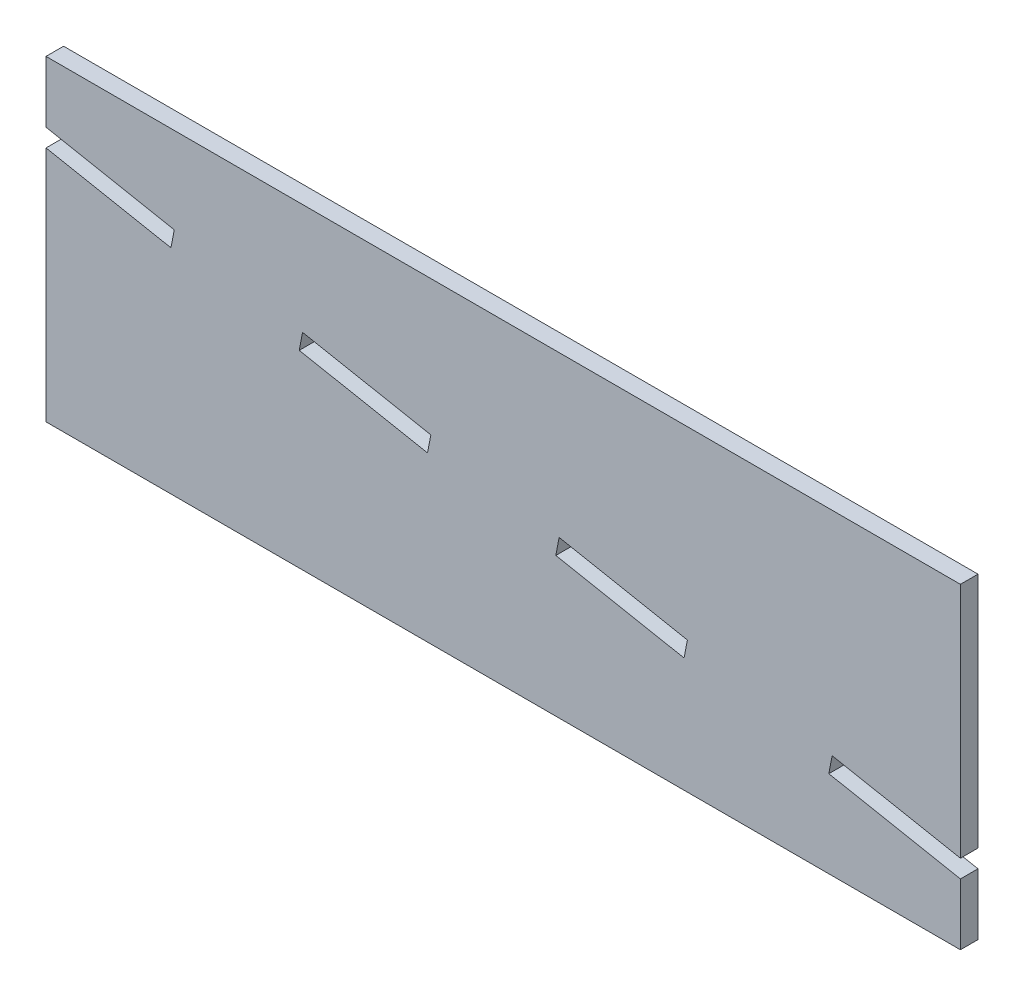
ISO-10303-21;
HEADER;
FILE_DESCRIPTION(('STEP AP214'),'2;1');
FILE_NAME('part.step','',(''),(''),'','','');
FILE_SCHEMA(('AUTOMOTIVE_DESIGN { 1 0 10303 214 1 1 1 1 }'));
ENDSEC;
DATA;
#1=APPLICATION_CONTEXT('core data for automotive mechanical design processes');
#2=APPLICATION_PROTOCOL_DEFINITION('international standard','automotive_design',2000,#1);
#3=PRODUCT_CONTEXT('',#1,'mechanical');
#4=PRODUCT('Part','Part','',(#3));
#5=PRODUCT_RELATED_PRODUCT_CATEGORY('part','',(#4));
#6=PRODUCT_DEFINITION_FORMATION('','',#4);
#7=PRODUCT_DEFINITION_CONTEXT('part definition',#1,'design');
#8=PRODUCT_DEFINITION('design','',#6,#7);
#9=PRODUCT_DEFINITION_SHAPE('','',#8);
#10=(LENGTH_UNIT() NAMED_UNIT(*) SI_UNIT(.MILLI.,.METRE.));
#11=(NAMED_UNIT(*) PLANE_ANGLE_UNIT() SI_UNIT($,.RADIAN.));
#12=(NAMED_UNIT(*) SI_UNIT($,.STERADIAN.) SOLID_ANGLE_UNIT());
#13=UNCERTAINTY_MEASURE_WITH_UNIT(LENGTH_MEASURE(1.E-05),#10,'distance_accuracy_value','');
#14=(GEOMETRIC_REPRESENTATION_CONTEXT(3) GLOBAL_UNCERTAINTY_ASSIGNED_CONTEXT((#13)) GLOBAL_UNIT_ASSIGNED_CONTEXT((#10,
#11,#12)) REPRESENTATION_CONTEXT('',''));
#15=CARTESIAN_POINT('',(0.,0.,0.));
#16=DIRECTION('',(0.,0.,1.));
#17=DIRECTION('',(1.,0.,0.));
#18=AXIS2_PLACEMENT_3D('',#15,#16,#17);
#19=CARTESIAN_POINT('',(0.,0.,5.));
#20=DIRECTION('',(0.,0.,-1.));
#21=DIRECTION('',(-1.,0.,0.));
#22=AXIS2_PLACEMENT_3D('',#19,#20,#21);
#23=PLANE('',#22);
#24=DIRECTION('',(0.982006446980647,-0.188847393650125,0.));
#25=VECTOR('',#24,1.);
#26=CARTESIAN_POINT('',(108.47933855245,46.5927806062838,5.));
#27=LINE('',#26,#25);
#28=CARTESIAN_POINT('',(72.0048133788832,53.6071123704313,5.));
#29=VERTEX_POINT('',#28);
#30=CARTESIAN_POINT('',(108.47933855245,46.5927806062838,5.));
#31=VERTEX_POINT('',#30);
#32=EDGE_CURVE('E226',#29,#31,#27,.T.);
#33=ORIENTED_EDGE('',*,*,#32,.F.);
#34=DIRECTION('',(-0.188847393650126,-0.982006446980647,0.));
#35=VECTOR('',#34,1.);
#36=CARTESIAN_POINT('',(72.0048133788832,53.6071123704313,5.));
#37=LINE('',#36,#35);
#38=CARTESIAN_POINT('',(72.9490503471338,58.5171446053346,5.));
#39=VERTEX_POINT('',#38);
#40=EDGE_CURVE('E223',#39,#29,#37,.T.);
#41=ORIENTED_EDGE('',*,*,#40,.F.);
#42=DIRECTION('',(-0.982006446980647,0.188847393650124,0.));
#43=VECTOR('',#42,1.);
#44=CARTESIAN_POINT('',(72.9490503471338,58.5171446053346,5.));
#45=LINE('',#44,#43);
#46=CARTESIAN_POINT('',(109.423575520701,51.5028128411871,5.));
#47=VERTEX_POINT('',#46);
#48=EDGE_CURVE('E233',#47,#39,#45,.T.);
#49=ORIENTED_EDGE('',*,*,#48,.F.);
#50=DIRECTION('',(0.188847393650129,0.982006446980647,0.));
#51=VECTOR('',#50,1.);
#52=CARTESIAN_POINT('',(108.951457036575,49.0477967237355,5.));
#53=LINE('',#52,#51);
#54=EDGE_CURVE('E230',#31,#47,#53,.T.);
#55=ORIENTED_EDGE('',*,*,#54,.F.);
#56=EDGE_LOOP('',(#33,#41,#49,#55));
#57=FACE_BOUND('',#56,.T.);
#58=DIRECTION('',(0.,-1.,0.));
#59=VECTOR('',#58,1.);
#60=CARTESIAN_POINT('',(0.,0.,5.));
#61=LINE('',#60,#59);
#62=CARTESIAN_POINT('',(0.,67.4541918663705,5.));
#63=VERTEX_POINT('',#62);
#64=CARTESIAN_POINT('',(0.,0.,5.));
#65=VERTEX_POINT('',#64);
#66=EDGE_CURVE('E265',#63,#65,#61,.T.);
#67=ORIENTED_EDGE('',*,*,#66,.T.);
#68=DIRECTION('',(1.,0.,0.));
#69=VECTOR('',#68,1.);
#70=CARTESIAN_POINT('',(0.,0.,5.));
#71=LINE('',#70,#69);
#72=CARTESIAN_POINT('',(260.,0.,5.));
#73=VERTEX_POINT('',#72);
#74=EDGE_CURVE('E269',#65,#73,#71,.T.);
#75=ORIENTED_EDGE('',*,*,#74,.T.);
#76=DIRECTION('',(0.,1.,0.));
#77=VECTOR('',#76,1.);
#78=CARTESIAN_POINT('',(260.,0.,5.));
#79=LINE('',#78,#77);
#80=CARTESIAN_POINT('',(260.,17.4541918663704,5.));
#81=VERTEX_POINT('',#80);
#82=EDGE_CURVE('E273',#73,#81,#79,.T.);
#83=ORIENTED_EDGE('',*,*,#82,.T.);
#84=DIRECTION('',(-0.982006446980647,0.188847393650125,0.));
#85=VECTOR('',#84,1.);
#86=CARTESIAN_POINT('',(260.,17.4541918663704,5.));
#87=LINE('',#86,#85);
#88=CARTESIAN_POINT('',(222.581237858183,24.6501076628737,5.));
#89=VERTEX_POINT('',#88);
#90=EDGE_CURVE('E276',#81,#89,#87,.T.);
#91=ORIENTED_EDGE('',*,*,#90,.T.);
#92=DIRECTION('',(0.188847393650121,0.982006446980648,0.));
#93=VECTOR('',#92,1.);
#94=CARTESIAN_POINT('',(222.581237858183,24.6501076628737,5.));
#95=LINE('',#94,#93);
#96=CARTESIAN_POINT('',(223.525474826433,29.560139897777,5.));
#97=VERTEX_POINT('',#96);
#98=EDGE_CURVE('E279',#89,#97,#95,.T.);
#99=ORIENTED_EDGE('',*,*,#98,.T.);
#100=DIRECTION('',(0.982006446980647,-0.188847393650125,0.));
#101=VECTOR('',#100,1.);
#102=CARTESIAN_POINT('',(223.525474826433,29.560139897777,5.));
#103=LINE('',#102,#101);
#104=CARTESIAN_POINT('',(260.,22.5458081336295,5.));
#105=VERTEX_POINT('',#104);
#106=EDGE_CURVE('E282',#97,#105,#103,.T.);
#107=ORIENTED_EDGE('',*,*,#106,.T.);
#108=DIRECTION('',(0.,1.,0.));
#109=VECTOR('',#108,1.);
#110=CARTESIAN_POINT('',(260.,22.5458081336295,5.));
#111=LINE('',#110,#109);
#112=CARTESIAN_POINT('',(260.,90.,5.));
#113=VERTEX_POINT('',#112);
#114=EDGE_CURVE('E285',#105,#113,#111,.T.);
#115=ORIENTED_EDGE('',*,*,#114,.T.);
#116=DIRECTION('',(-1.,0.,0.));
#117=VECTOR('',#116,1.);
#118=CARTESIAN_POINT('',(0.,90.,5.));
#119=LINE('',#118,#117);
#120=CARTESIAN_POINT('',(0.,90.,5.));
#121=VERTEX_POINT('',#120);
#122=EDGE_CURVE('E288',#113,#121,#119,.T.);
#123=ORIENTED_EDGE('',*,*,#122,.T.);
#124=DIRECTION('',(0.,-1.,0.));
#125=VECTOR('',#124,1.);
#126=CARTESIAN_POINT('',(0.,72.5458081336296,5.));
#127=LINE('',#126,#125);
#128=CARTESIAN_POINT('',(0.,72.5458081336296,5.));
#129=VERTEX_POINT('',#128);
#130=EDGE_CURVE('E291',#121,#129,#127,.T.);
#131=ORIENTED_EDGE('',*,*,#130,.T.);
#132=DIRECTION('',(0.982006446980647,-0.188847393650125,0.));
#133=VECTOR('',#132,1.);
#134=CARTESIAN_POINT('',(36.4745251735669,65.5314763694821,5.));
#135=LINE('',#134,#133);
#136=CARTESIAN_POINT('',(36.4745251735669,65.5314763694821,5.));
#137=VERTEX_POINT('',#136);
#138=EDGE_CURVE('E294',#129,#137,#135,.T.);
#139=ORIENTED_EDGE('',*,*,#138,.T.);
#140=DIRECTION('',(-0.188847393650124,-0.982006446980647,0.));
#141=VECTOR('',#140,1.);
#142=CARTESIAN_POINT('',(36.0024066894416,63.0764602520305,5.));
#143=LINE('',#142,#141);
#144=CARTESIAN_POINT('',(35.5302882053163,60.6214441345788,5.));
#145=VERTEX_POINT('',#144);
#146=EDGE_CURVE('E297',#137,#145,#143,.T.);
#147=ORIENTED_EDGE('',*,*,#146,.T.);
#148=DIRECTION('',(-0.982006446980647,0.188847393650125,0.));
#149=VECTOR('',#148,1.);
#150=CARTESIAN_POINT('',(0.,67.4541918663705,5.));
#151=LINE('',#150,#149);
#152=EDGE_CURVE('E300',#145,#63,#151,.T.);
#153=ORIENTED_EDGE('',*,*,#152,.T.);
#154=EDGE_LOOP('',(#67,#75,#83,#91,#99,#107,#115,#123,#131,#139,#147,#153));
#155=FACE_BOUND('',#154,.T.);
#156=DIRECTION('',(0.982006446980647,-0.188847393650125,0.));
#157=VECTOR('',#156,1.);
#158=CARTESIAN_POINT('',(181.428388899584,32.5641170779889,5.));
#159=LINE('',#158,#157);
#160=CARTESIAN_POINT('',(144.953863726017,39.5784488421363,5.));
#161=VERTEX_POINT('',#160);
#162=CARTESIAN_POINT('',(181.428388899584,32.5641170779889,5.));
#163=VERTEX_POINT('',#162);
#164=EDGE_CURVE('E180',#161,#163,#159,.T.);
#165=ORIENTED_EDGE('',*,*,#164,.F.);
#166=DIRECTION('',(-0.188847393650111,-0.98200644698065,0.));
#167=VECTOR('',#166,1.);
#168=CARTESIAN_POINT('',(144.953863726017,39.5784488421363,5.));
#169=LINE('',#168,#167);
#170=CARTESIAN_POINT('',(145.898100694268,44.4884810770396,5.));
#171=VERTEX_POINT('',#170);
#172=EDGE_CURVE('E174',#171,#161,#169,.T.);
#173=ORIENTED_EDGE('',*,*,#172,.F.);
#174=DIRECTION('',(-0.982006446980647,0.188847393650125,0.));
#175=VECTOR('',#174,1.);
#176=CARTESIAN_POINT('',(145.898100694268,44.4884810770396,5.));
#177=LINE('',#176,#175);
#178=CARTESIAN_POINT('',(182.372625867834,37.4741493128921,5.));
#179=VERTEX_POINT('',#178);
#180=EDGE_CURVE('E199',#179,#171,#177,.T.);
#181=ORIENTED_EDGE('',*,*,#180,.F.);
#182=DIRECTION('',(0.188847393650122,0.982006446980648,0.));
#183=VECTOR('',#182,1.);
#184=CARTESIAN_POINT('',(181.900507383709,35.0191331954405,5.));
#185=LINE('',#184,#183);
#186=EDGE_CURVE('E195',#163,#179,#185,.T.);
#187=ORIENTED_EDGE('',*,*,#186,.F.);
#188=EDGE_LOOP('',(#165,#173,#181,#187));
#189=FACE_BOUND('',#188,.T.);
#190=ADVANCED_FACE('F39',(#57,#155,#189),#23,.F.);
#191=CARTESIAN_POINT('',(0.,0.,0.));
#192=DIRECTION('',(0.,0.,-1.));
#193=DIRECTION('',(-1.,0.,0.));
#194=AXIS2_PLACEMENT_3D('',#191,#192,#193);
#195=PLANE('',#194);
#196=DIRECTION('',(0.,-1.,0.));
#197=VECTOR('',#196,1.);
#198=CARTESIAN_POINT('',(0.,0.,0.));
#199=LINE('',#198,#197);
#200=CARTESIAN_POINT('',(0.,67.4541918663705,0.));
#201=VERTEX_POINT('',#200);
#202=CARTESIAN_POINT('',(0.,0.,0.));
#203=VERTEX_POINT('',#202);
#204=EDGE_CURVE('E264',#201,#203,#199,.T.);
#205=ORIENTED_EDGE('',*,*,#204,.F.);
#206=DIRECTION('',(-0.982006446980647,0.188847393650125,0.));
#207=VECTOR('',#206,1.);
#208=CARTESIAN_POINT('',(0.,67.4541918663705,0.));
#209=LINE('',#208,#207);
#210=CARTESIAN_POINT('',(35.5302882053163,60.6214441345788,0.));
#211=VERTEX_POINT('',#210);
#212=EDGE_CURVE('E270',#211,#201,#209,.T.);
#213=ORIENTED_EDGE('',*,*,#212,.F.);
#214=DIRECTION('',(-0.188847393650124,-0.982006446980648,0.));
#215=VECTOR('',#214,1.);
#216=CARTESIAN_POINT('',(35.5302882053163,60.6214441345788,0.));
#217=LINE('',#216,#215);
#218=CARTESIAN_POINT('',(36.4745251735669,65.5314763694821,0.));
#219=VERTEX_POINT('',#218);
#220=EDGE_CURVE('E336',#219,#211,#217,.T.);
#221=ORIENTED_EDGE('',*,*,#220,.F.);
#222=DIRECTION('',(0.982006446980647,-0.188847393650125,0.));
#223=VECTOR('',#222,1.);
#224=CARTESIAN_POINT('',(36.4745251735669,65.5314763694821,0.));
#225=LINE('',#224,#223);
#226=CARTESIAN_POINT('',(0.,72.5458081336296,0.));
#227=VERTEX_POINT('',#226);
#228=EDGE_CURVE('E332',#227,#219,#225,.T.);
#229=ORIENTED_EDGE('',*,*,#228,.F.);
#230=DIRECTION('',(0.,-1.,0.));
#231=VECTOR('',#230,1.);
#232=CARTESIAN_POINT('',(0.,72.5458081336296,0.));
#233=LINE('',#232,#231);
#234=CARTESIAN_POINT('',(0.,90.,0.));
#235=VERTEX_POINT('',#234);
#236=EDGE_CURVE('E329',#235,#227,#233,.T.);
#237=ORIENTED_EDGE('',*,*,#236,.F.);
#238=DIRECTION('',(-1.,0.,0.));
#239=VECTOR('',#238,1.);
#240=CARTESIAN_POINT('',(0.,90.,0.));
#241=LINE('',#240,#239);
#242=CARTESIAN_POINT('',(260.,90.,0.));
#243=VERTEX_POINT('',#242);
#244=EDGE_CURVE('E326',#243,#235,#241,.T.);
#245=ORIENTED_EDGE('',*,*,#244,.F.);
#246=DIRECTION('',(0.,1.,0.));
#247=VECTOR('',#246,1.);
#248=CARTESIAN_POINT('',(260.,22.5458081336295,0.));
#249=LINE('',#248,#247);
#250=CARTESIAN_POINT('',(260.,22.5458081336295,0.));
#251=VERTEX_POINT('',#250);
#252=EDGE_CURVE('E323',#251,#243,#249,.T.);
#253=ORIENTED_EDGE('',*,*,#252,.F.);
#254=DIRECTION('',(0.982006446980647,-0.188847393650125,0.));
#255=VECTOR('',#254,1.);
#256=CARTESIAN_POINT('',(223.525474826433,29.560139897777,0.));
#257=LINE('',#256,#255);
#258=CARTESIAN_POINT('',(223.525474826433,29.560139897777,0.));
#259=VERTEX_POINT('',#258);
#260=EDGE_CURVE('E320',#259,#251,#257,.T.);
#261=ORIENTED_EDGE('',*,*,#260,.F.);
#262=DIRECTION('',(0.188847393650098,0.982006446980652,0.));
#263=VECTOR('',#262,1.);
#264=CARTESIAN_POINT('',(223.053356342308,27.1051237803254,0.));
#265=LINE('',#264,#263);
#266=CARTESIAN_POINT('',(222.581237858183,24.6501076628737,0.));
#267=VERTEX_POINT('',#266);
#268=EDGE_CURVE('E317',#267,#259,#265,.T.);
#269=ORIENTED_EDGE('',*,*,#268,.F.);
#270=DIRECTION('',(-0.982006446980647,0.188847393650125,0.));
#271=VECTOR('',#270,1.);
#272=CARTESIAN_POINT('',(260.,17.4541918663704,0.));
#273=LINE('',#272,#271);
#274=CARTESIAN_POINT('',(260.,17.4541918663704,0.));
#275=VERTEX_POINT('',#274);
#276=EDGE_CURVE('E313',#275,#267,#273,.T.);
#277=ORIENTED_EDGE('',*,*,#276,.F.);
#278=DIRECTION('',(0.,1.,0.));
#279=VECTOR('',#278,1.);
#280=CARTESIAN_POINT('',(260.,0.,0.));
#281=LINE('',#280,#279);
#282=CARTESIAN_POINT('',(260.,0.,0.));
#283=VERTEX_POINT('',#282);
#284=EDGE_CURVE('E310',#283,#275,#281,.T.);
#285=ORIENTED_EDGE('',*,*,#284,.F.);
#286=DIRECTION('',(1.,0.,0.));
#287=VECTOR('',#286,1.);
#288=CARTESIAN_POINT('',(0.,0.,0.));
#289=LINE('',#288,#287);
#290=EDGE_CURVE('E307',#203,#283,#289,.T.);
#291=ORIENTED_EDGE('',*,*,#290,.F.);
#292=EDGE_LOOP('',(#205,#213,#221,#229,#237,#245,#253,#261,#269,#277,#285,#291));
#293=FACE_BOUND('',#292,.T.);
#294=DIRECTION('',(-0.188847393650122,-0.982006446980648,0.));
#295=VECTOR('',#294,1.);
#296=CARTESIAN_POINT('',(72.4769318630085,56.062128487883,0.));
#297=LINE('',#296,#295);
#298=CARTESIAN_POINT('',(72.9490503471338,58.5171446053346,0.));
#299=VERTEX_POINT('',#298);
#300=CARTESIAN_POINT('',(72.0048133788832,53.6071123704313,0.));
#301=VERTEX_POINT('',#300);
#302=EDGE_CURVE('E227',#299,#301,#297,.T.);
#303=ORIENTED_EDGE('',*,*,#302,.T.);
#304=DIRECTION('',(0.982006446980647,-0.188847393650125,0.));
#305=VECTOR('',#304,1.);
#306=CARTESIAN_POINT('',(108.47933855245,46.5927806062838,0.));
#307=LINE('',#306,#305);
#308=CARTESIAN_POINT('',(108.47933855245,46.5927806062838,0.));
#309=VERTEX_POINT('',#308);
#310=EDGE_CURVE('E191',#301,#309,#307,.T.);
#311=ORIENTED_EDGE('',*,*,#310,.T.);
#312=DIRECTION('',(0.188847393650112,0.98200644698065,0.));
#313=VECTOR('',#312,1.);
#314=CARTESIAN_POINT('',(109.423575520701,51.5028128411871,0.));
#315=LINE('',#314,#313);
#316=CARTESIAN_POINT('',(109.423575520701,51.5028128411871,0.));
#317=VERTEX_POINT('',#316);
#318=EDGE_CURVE('E241',#309,#317,#315,.T.);
#319=ORIENTED_EDGE('',*,*,#318,.T.);
#320=DIRECTION('',(-0.982006446980647,0.188847393650124,0.));
#321=VECTOR('',#320,1.);
#322=CARTESIAN_POINT('',(72.9490503471338,58.5171446053346,0.));
#323=LINE('',#322,#321);
#324=EDGE_CURVE('E245',#317,#299,#323,.T.);
#325=ORIENTED_EDGE('',*,*,#324,.T.);
#326=EDGE_LOOP('',(#303,#311,#319,#325));
#327=FACE_BOUND('',#326,.T.);
#328=DIRECTION('',(-0.188847393650119,-0.982006446980648,0.));
#329=VECTOR('',#328,1.);
#330=CARTESIAN_POINT('',(145.425982210142,42.033464959588,0.));
#331=LINE('',#330,#329);
#332=CARTESIAN_POINT('',(145.898100694268,44.4884810770396,0.));
#333=VERTEX_POINT('',#332);
#334=CARTESIAN_POINT('',(144.953863726017,39.5784488421364,0.));
#335=VERTEX_POINT('',#334);
#336=EDGE_CURVE('E181',#333,#335,#331,.T.);
#337=ORIENTED_EDGE('',*,*,#336,.T.);
#338=DIRECTION('',(0.982006446980647,-0.188847393650125,0.));
#339=VECTOR('',#338,1.);
#340=CARTESIAN_POINT('',(181.428388899584,32.5641170779889,0.));
#341=LINE('',#340,#339);
#342=CARTESIAN_POINT('',(181.428388899584,32.5641170779889,0.));
#343=VERTEX_POINT('',#342);
#344=EDGE_CURVE('E188',#335,#343,#341,.T.);
#345=ORIENTED_EDGE('',*,*,#344,.T.);
#346=DIRECTION('',(0.188847393650119,0.982006446980648,0.));
#347=VECTOR('',#346,1.);
#348=CARTESIAN_POINT('',(182.372625867834,37.4741493128921,0.));
#349=LINE('',#348,#347);
#350=CARTESIAN_POINT('',(182.372625867834,37.4741493128921,0.));
#351=VERTEX_POINT('',#350);
#352=EDGE_CURVE('E206',#343,#351,#349,.T.);
#353=ORIENTED_EDGE('',*,*,#352,.T.);
#354=DIRECTION('',(-0.982006446980647,0.188847393650125,0.));
#355=VECTOR('',#354,1.);
#356=CARTESIAN_POINT('',(145.898100694268,44.4884810770396,0.));
#357=LINE('',#356,#355);
#358=EDGE_CURVE('E210',#351,#333,#357,.T.);
#359=ORIENTED_EDGE('',*,*,#358,.T.);
#360=EDGE_LOOP('',(#337,#345,#353,#359));
#361=FACE_BOUND('',#360,.T.);
#362=ADVANCED_FACE('F391',(#293,#327,#361),#195,.T.);
#363=CARTESIAN_POINT('',(0.,0.,5.));
#364=DIRECTION('',(1.,0.,0.));
#365=DIRECTION('',(0.,0.,-1.));
#366=AXIS2_PLACEMENT_3D('',#363,#364,#365);
#367=PLANE('',#366);
#368=ORIENTED_EDGE('',*,*,#204,.T.);
#369=DIRECTION('',(0.,0.,-1.));
#370=VECTOR('',#369,1.);
#371=CARTESIAN_POINT('',(0.,0.,5.));
#372=LINE('',#371,#370);
#373=EDGE_CURVE('E11',#65,#203,#372,.T.);
#374=ORIENTED_EDGE('',*,*,#373,.F.);
#375=ORIENTED_EDGE('',*,*,#66,.F.);
#376=DIRECTION('',(0.,0.,-1.));
#377=VECTOR('',#376,1.);
#378=CARTESIAN_POINT('',(0.,67.4541918663705,5.));
#379=LINE('',#378,#377);
#380=EDGE_CURVE('E303',#63,#201,#379,.T.);
#381=ORIENTED_EDGE('',*,*,#380,.T.);
#382=EDGE_LOOP('',(#368,#374,#375,#381));
#383=FACE_BOUND('',#382,.T.);
#384=ADVANCED_FACE('F41',(#383),#367,.F.);
#385=CARTESIAN_POINT('',(0.,0.,5.));
#386=DIRECTION('',(0.,1.,0.));
#387=DIRECTION('',(-1.,0.,0.));
#388=AXIS2_PLACEMENT_3D('',#385,#386,#387);
#389=PLANE('',#388);
#390=ORIENTED_EDGE('',*,*,#290,.T.);
#391=DIRECTION('',(0.,0.,-1.));
#392=VECTOR('',#391,1.);
#393=CARTESIAN_POINT('',(260.,0.,5.));
#394=LINE('',#393,#392);
#395=EDGE_CURVE('E48',#73,#283,#394,.T.);
#396=ORIENTED_EDGE('',*,*,#395,.F.);
#397=ORIENTED_EDGE('',*,*,#74,.F.);
#398=ORIENTED_EDGE('',*,*,#373,.T.);
#399=EDGE_LOOP('',(#390,#396,#397,#398));
#400=FACE_BOUND('',#399,.T.);
#401=ADVANCED_FACE('F407',(#400),#389,.F.);
#402=CARTESIAN_POINT('',(260.,0.,5.));
#403=DIRECTION('',(-1.,0.,0.));
#404=DIRECTION('',(0.,0.,1.));
#405=AXIS2_PLACEMENT_3D('',#402,#403,#404);
#406=PLANE('',#405);
#407=ORIENTED_EDGE('',*,*,#284,.T.);
#408=DIRECTION('',(0.,0.,-1.));
#409=VECTOR('',#408,1.);
#410=CARTESIAN_POINT('',(260.,17.4541918663704,5.));
#411=LINE('',#410,#409);
#412=EDGE_CURVE('E376',#81,#275,#411,.T.);
#413=ORIENTED_EDGE('',*,*,#412,.F.);
#414=ORIENTED_EDGE('',*,*,#82,.F.);
#415=ORIENTED_EDGE('',*,*,#395,.T.);
#416=EDGE_LOOP('',(#407,#413,#414,#415));
#417=FACE_BOUND('',#416,.T.);
#418=ADVANCED_FACE('F385',(#417),#406,.F.);
#419=CARTESIAN_POINT('',(260.,17.4541918663704,5.));
#420=DIRECTION('',(-0.188847393650125,-0.982006446980647,0.));
#421=DIRECTION('',(0.982006446980647,-0.188847393650125,0.));
#422=AXIS2_PLACEMENT_3D('',#419,#420,#421);
#423=PLANE('',#422);
#424=ORIENTED_EDGE('',*,*,#276,.T.);
#425=DIRECTION('',(0.,0.,-1.));
#426=VECTOR('',#425,1.);
#427=CARTESIAN_POINT('',(222.581237858183,24.6501076628737,5.));
#428=LINE('',#427,#426);
#429=EDGE_CURVE('E372',#89,#267,#428,.T.);
#430=ORIENTED_EDGE('',*,*,#429,.F.);
#431=ORIENTED_EDGE('',*,*,#90,.F.);
#432=ORIENTED_EDGE('',*,*,#412,.T.);
#433=EDGE_LOOP('',(#424,#430,#431,#432));
#434=FACE_BOUND('',#433,.T.);
#435=ADVANCED_FACE('F396',(#434),#423,.F.);
#436=CARTESIAN_POINT('',(223.053356342308,27.1051237803254,5.));
#437=DIRECTION('',(-0.982006446980653,0.188847393650098,0.));
#438=DIRECTION('',(-0.188847393650098,-0.982006446980653,0.));
#439=AXIS2_PLACEMENT_3D('',#436,#437,#438);
#440=PLANE('',#439);
#441=ORIENTED_EDGE('',*,*,#268,.T.);
#442=DIRECTION('',(0.,0.,-1.));
#443=VECTOR('',#442,1.);
#444=CARTESIAN_POINT('',(223.525474826433,29.560139897777,5.));
#445=LINE('',#444,#443);
#446=EDGE_CURVE('E368',#97,#259,#445,.T.);
#447=ORIENTED_EDGE('',*,*,#446,.F.);
#448=ORIENTED_EDGE('',*,*,#98,.F.);
#449=ORIENTED_EDGE('',*,*,#429,.T.);
#450=EDGE_LOOP('',(#441,#447,#448,#449));
#451=FACE_BOUND('',#450,.T.);
#452=ADVANCED_FACE('F400',(#451),#440,.F.);
#453=CARTESIAN_POINT('',(223.525474826433,29.560139897777,5.));
#454=DIRECTION('',(0.188847393650125,0.982006446980647,0.));
#455=DIRECTION('',(-0.982006446980647,0.188847393650125,0.));
#456=AXIS2_PLACEMENT_3D('',#453,#454,#455);
#457=PLANE('',#456);
#458=ORIENTED_EDGE('',*,*,#260,.T.);
#459=DIRECTION('',(0.,0.,-1.));
#460=VECTOR('',#459,1.);
#461=CARTESIAN_POINT('',(260.,22.5458081336295,5.));
#462=LINE('',#461,#460);
#463=EDGE_CURVE('E364',#105,#251,#462,.T.);
#464=ORIENTED_EDGE('',*,*,#463,.F.);
#465=ORIENTED_EDGE('',*,*,#106,.F.);
#466=ORIENTED_EDGE('',*,*,#446,.T.);
#467=EDGE_LOOP('',(#458,#464,#465,#466));
#468=FACE_BOUND('',#467,.T.);
#469=ADVANCED_FACE('F439',(#468),#457,.F.);
#470=CARTESIAN_POINT('',(260.,22.5458081336295,5.));
#471=DIRECTION('',(-1.,0.,0.));
#472=DIRECTION('',(0.,0.,1.));
#473=AXIS2_PLACEMENT_3D('',#470,#471,#472);
#474=PLANE('',#473);
#475=ORIENTED_EDGE('',*,*,#252,.T.);
#476=DIRECTION('',(0.,0.,-1.));
#477=VECTOR('',#476,1.);
#478=CARTESIAN_POINT('',(260.,90.,5.));
#479=LINE('',#478,#477);
#480=EDGE_CURVE('E360',#113,#243,#479,.T.);
#481=ORIENTED_EDGE('',*,*,#480,.F.);
#482=ORIENTED_EDGE('',*,*,#114,.F.);
#483=ORIENTED_EDGE('',*,*,#463,.T.);
#484=EDGE_LOOP('',(#475,#481,#482,#483));
#485=FACE_BOUND('',#484,.T.);
#486=ADVANCED_FACE('F437',(#485),#474,.F.);
#487=CARTESIAN_POINT('',(0.,90.,5.));
#488=DIRECTION('',(0.,-1.,0.));
#489=DIRECTION('',(0.,0.,-1.));
#490=AXIS2_PLACEMENT_3D('',#487,#488,#489);
#491=PLANE('',#490);
#492=ORIENTED_EDGE('',*,*,#244,.T.);
#493=DIRECTION('',(0.,0.,-1.));
#494=VECTOR('',#493,1.);
#495=CARTESIAN_POINT('',(0.,90.,5.));
#496=LINE('',#495,#494);
#497=EDGE_CURVE('E356',#121,#235,#496,.T.);
#498=ORIENTED_EDGE('',*,*,#497,.F.);
#499=ORIENTED_EDGE('',*,*,#122,.F.);
#500=ORIENTED_EDGE('',*,*,#480,.T.);
#501=EDGE_LOOP('',(#492,#498,#499,#500));
#502=FACE_BOUND('',#501,.T.);
#503=ADVANCED_FACE('F433',(#502),#491,.F.);
#504=CARTESIAN_POINT('',(0.,72.5458081336296,5.));
#505=DIRECTION('',(1.,0.,0.));
#506=DIRECTION('',(0.,1.,0.));
#507=AXIS2_PLACEMENT_3D('',#504,#505,#506);
#508=PLANE('',#507);
#509=ORIENTED_EDGE('',*,*,#236,.T.);
#510=DIRECTION('',(0.,0.,-1.));
#511=VECTOR('',#510,1.);
#512=CARTESIAN_POINT('',(0.,72.5458081336296,5.));
#513=LINE('',#512,#511);
#514=EDGE_CURVE('E352',#129,#227,#513,.T.);
#515=ORIENTED_EDGE('',*,*,#514,.F.);
#516=ORIENTED_EDGE('',*,*,#130,.F.);
#517=ORIENTED_EDGE('',*,*,#497,.T.);
#518=EDGE_LOOP('',(#509,#515,#516,#517));
#519=FACE_BOUND('',#518,.T.);
#520=ADVANCED_FACE('F428',(#519),#508,.F.);
#521=CARTESIAN_POINT('',(36.4745251735669,65.5314763694821,5.));
#522=DIRECTION('',(0.188847393650125,0.982006446980647,0.));
#523=DIRECTION('',(-0.982006446980647,0.188847393650125,0.));
#524=AXIS2_PLACEMENT_3D('',#521,#522,#523);
#525=PLANE('',#524);
#526=ORIENTED_EDGE('',*,*,#228,.T.);
#527=DIRECTION('',(0.,0.,-1.));
#528=VECTOR('',#527,1.);
#529=CARTESIAN_POINT('',(36.4745251735669,65.5314763694821,5.));
#530=LINE('',#529,#528);
#531=EDGE_CURVE('E348',#137,#219,#530,.T.);
#532=ORIENTED_EDGE('',*,*,#531,.F.);
#533=ORIENTED_EDGE('',*,*,#138,.F.);
#534=ORIENTED_EDGE('',*,*,#514,.T.);
#535=EDGE_LOOP('',(#526,#532,#533,#534));
#536=FACE_BOUND('',#535,.T.);
#537=ADVANCED_FACE('F422',(#536),#525,.F.);
#538=CARTESIAN_POINT('',(35.5302882053163,60.6214441345788,5.));
#539=DIRECTION('',(0.982006446980648,-0.188847393650124,0.));
#540=DIRECTION('',(0.188847393650124,0.982006446980648,0.));
#541=AXIS2_PLACEMENT_3D('',#538,#539,#540);
#542=PLANE('',#541);
#543=ORIENTED_EDGE('',*,*,#220,.T.);
#544=DIRECTION('',(0.,0.,-1.));
#545=VECTOR('',#544,1.);
#546=CARTESIAN_POINT('',(35.5302882053163,60.6214441345788,5.));
#547=LINE('',#546,#545);
#548=EDGE_CURVE('E344',#145,#211,#547,.T.);
#549=ORIENTED_EDGE('',*,*,#548,.F.);
#550=ORIENTED_EDGE('',*,*,#146,.F.);
#551=ORIENTED_EDGE('',*,*,#531,.T.);
#552=EDGE_LOOP('',(#543,#549,#550,#551));
#553=FACE_BOUND('',#552,.T.);
#554=ADVANCED_FACE('F418',(#553),#542,.F.);
#555=CARTESIAN_POINT('',(0.,67.4541918663705,5.));
#556=DIRECTION('',(-0.188847393650125,-0.982006446980647,0.));
#557=DIRECTION('',(0.982006446980647,-0.188847393650125,0.));
#558=AXIS2_PLACEMENT_3D('',#555,#556,#557);
#559=PLANE('',#558);
#560=ORIENTED_EDGE('',*,*,#212,.T.);
#561=ORIENTED_EDGE('',*,*,#380,.F.);
#562=ORIENTED_EDGE('',*,*,#152,.F.);
#563=ORIENTED_EDGE('',*,*,#548,.T.);
#564=EDGE_LOOP('',(#560,#561,#562,#563));
#565=FACE_BOUND('',#564,.T.);
#566=ADVANCED_FACE('F413',(#565),#559,.F.);
#567=CARTESIAN_POINT('',(108.47933855245,46.5927806062838,5.));
#568=DIRECTION('',(0.188847393650125,0.982006446980647,0.));
#569=DIRECTION('',(-0.982006446980647,0.188847393650125,0.));
#570=AXIS2_PLACEMENT_3D('',#567,#568,#569);
#571=PLANE('',#570);
#572=ORIENTED_EDGE('',*,*,#310,.F.);
#573=DIRECTION('',(0.,0.,-1.));
#574=VECTOR('',#573,1.);
#575=CARTESIAN_POINT('',(72.0048133788832,53.6071123704313,5.));
#576=LINE('',#575,#574);
#577=EDGE_CURVE('E261',#29,#301,#576,.T.);
#578=ORIENTED_EDGE('',*,*,#577,.F.);
#579=ORIENTED_EDGE('',*,*,#32,.T.);
#580=DIRECTION('',(0.,0.,-1.));
#581=VECTOR('',#580,1.);
#582=CARTESIAN_POINT('',(108.47933855245,46.5927806062838,5.));
#583=LINE('',#582,#581);
#584=EDGE_CURVE('E257',#31,#309,#583,.T.);
#585=ORIENTED_EDGE('',*,*,#584,.T.);
#586=EDGE_LOOP('',(#572,#578,#579,#585));
#587=FACE_BOUND('',#586,.T.);
#588=ADVANCED_FACE('F457',(#587),#571,.T.);
#589=CARTESIAN_POINT('',(109.423575520701,51.5028128411871,5.));
#590=DIRECTION('',(-0.98200644698065,0.188847393650112,0.));
#591=DIRECTION('',(-0.188847393650112,-0.98200644698065,0.));
#592=AXIS2_PLACEMENT_3D('',#589,#590,#591);
#593=PLANE('',#592);
#594=ORIENTED_EDGE('',*,*,#318,.F.);
#595=ORIENTED_EDGE('',*,*,#584,.F.);
#596=ORIENTED_EDGE('',*,*,#54,.T.);
#597=DIRECTION('',(0.,0.,-1.));
#598=VECTOR('',#597,1.);
#599=CARTESIAN_POINT('',(109.423575520701,51.5028128411871,5.));
#600=LINE('',#599,#598);
#601=EDGE_CURVE('E254',#47,#317,#600,.T.);
#602=ORIENTED_EDGE('',*,*,#601,.T.);
#603=EDGE_LOOP('',(#594,#595,#596,#602));
#604=FACE_BOUND('',#603,.T.);
#605=ADVANCED_FACE('F495',(#604),#593,.T.);
#606=CARTESIAN_POINT('',(72.9490503471338,58.5171446053346,5.));
#607=DIRECTION('',(-0.188847393650124,-0.982006446980647,0.));
#608=DIRECTION('',(0.982006446980648,-0.188847393650125,0.));
#609=AXIS2_PLACEMENT_3D('',#606,#607,#608);
#610=PLANE('',#609);
#611=ORIENTED_EDGE('',*,*,#324,.F.);
#612=ORIENTED_EDGE('',*,*,#601,.F.);
#613=ORIENTED_EDGE('',*,*,#48,.T.);
#614=DIRECTION('',(0.,0.,-1.));
#615=VECTOR('',#614,1.);
#616=CARTESIAN_POINT('',(72.9490503471338,58.5171446053346,5.));
#617=LINE('',#616,#615);
#618=EDGE_CURVE('E237',#39,#299,#617,.T.);
#619=ORIENTED_EDGE('',*,*,#618,.T.);
#620=EDGE_LOOP('',(#611,#612,#613,#619));
#621=FACE_BOUND('',#620,.T.);
#622=ADVANCED_FACE('F502',(#621),#610,.T.);
#623=CARTESIAN_POINT('',(72.4769318630085,56.062128487883,5.));
#624=DIRECTION('',(0.982006446980648,-0.188847393650122,0.));
#625=DIRECTION('',(0.188847393650122,0.982006446980648,0.));
#626=AXIS2_PLACEMENT_3D('',#623,#624,#625);
#627=PLANE('',#626);
#628=ORIENTED_EDGE('',*,*,#302,.F.);
#629=ORIENTED_EDGE('',*,*,#618,.F.);
#630=ORIENTED_EDGE('',*,*,#40,.T.);
#631=ORIENTED_EDGE('',*,*,#577,.T.);
#632=EDGE_LOOP('',(#628,#629,#630,#631));
#633=FACE_BOUND('',#632,.T.);
#634=ADVANCED_FACE('F509',(#633),#627,.T.);
#635=CARTESIAN_POINT('',(181.428388899584,32.5641170779889,5.));
#636=DIRECTION('',(0.188847393650125,0.982006446980647,0.));
#637=DIRECTION('',(-0.982006446980647,0.188847393650125,0.));
#638=AXIS2_PLACEMENT_3D('',#635,#636,#637);
#639=PLANE('',#638);
#640=ORIENTED_EDGE('',*,*,#344,.F.);
#641=DIRECTION('',(0.,0.,-1.));
#642=VECTOR('',#641,1.);
#643=CARTESIAN_POINT('',(144.953863726017,39.5784488421363,5.));
#644=LINE('',#643,#642);
#645=EDGE_CURVE('E60',#161,#335,#644,.T.);
#646=ORIENTED_EDGE('',*,*,#645,.F.);
#647=ORIENTED_EDGE('',*,*,#164,.T.);
#648=DIRECTION('',(0.,0.,-1.));
#649=VECTOR('',#648,1.);
#650=CARTESIAN_POINT('',(181.428388899584,32.5641170779889,5.));
#651=LINE('',#650,#649);
#652=EDGE_CURVE('E192',#163,#343,#651,.T.);
#653=ORIENTED_EDGE('',*,*,#652,.T.);
#654=EDGE_LOOP('',(#640,#646,#647,#653));
#655=FACE_BOUND('',#654,.T.);
#656=ADVANCED_FACE('F184',(#655),#639,.T.);
#657=CARTESIAN_POINT('',(182.372625867834,37.4741493128921,5.));
#658=DIRECTION('',(-0.982006446980649,0.188847393650119,0.));
#659=DIRECTION('',(-0.188847393650119,-0.982006446980649,0.));
#660=AXIS2_PLACEMENT_3D('',#657,#658,#659);
#661=PLANE('',#660);
#662=ORIENTED_EDGE('',*,*,#352,.F.);
#663=ORIENTED_EDGE('',*,*,#652,.F.);
#664=ORIENTED_EDGE('',*,*,#186,.T.);
#665=DIRECTION('',(0.,0.,-1.));
#666=VECTOR('',#665,1.);
#667=CARTESIAN_POINT('',(182.372625867834,37.4741493128921,5.));
#668=LINE('',#667,#666);
#669=EDGE_CURVE('E218',#179,#351,#668,.T.);
#670=ORIENTED_EDGE('',*,*,#669,.T.);
#671=EDGE_LOOP('',(#662,#663,#664,#670));
#672=FACE_BOUND('',#671,.T.);
#673=ADVANCED_FACE('F524',(#672),#661,.T.);
#674=CARTESIAN_POINT('',(145.898100694268,44.4884810770396,5.));
#675=DIRECTION('',(-0.188847393650125,-0.982006446980647,0.));
#676=DIRECTION('',(0.982006446980647,-0.188847393650125,0.));
#677=AXIS2_PLACEMENT_3D('',#674,#675,#676);
#678=PLANE('',#677);
#679=ORIENTED_EDGE('',*,*,#358,.F.);
#680=ORIENTED_EDGE('',*,*,#669,.F.);
#681=ORIENTED_EDGE('',*,*,#180,.T.);
#682=DIRECTION('',(0.,0.,-1.));
#683=VECTOR('',#682,1.);
#684=CARTESIAN_POINT('',(145.898100694268,44.4884810770396,5.));
#685=LINE('',#684,#683);
#686=EDGE_CURVE('E55',#171,#333,#685,.T.);
#687=ORIENTED_EDGE('',*,*,#686,.T.);
#688=EDGE_LOOP('',(#679,#680,#681,#687));
#689=FACE_BOUND('',#688,.T.);
#690=ADVANCED_FACE('F531',(#689),#678,.T.);
#691=CARTESIAN_POINT('',(145.425982210142,42.033464959588,5.));
#692=DIRECTION('',(0.982006446980649,-0.188847393650119,0.));
#693=DIRECTION('',(0.188847393650119,0.982006446980649,0.));
#694=AXIS2_PLACEMENT_3D('',#691,#692,#693);
#695=PLANE('',#694);
#696=ORIENTED_EDGE('',*,*,#336,.F.);
#697=ORIENTED_EDGE('',*,*,#686,.F.);
#698=ORIENTED_EDGE('',*,*,#172,.T.);
#699=ORIENTED_EDGE('',*,*,#645,.T.);
#700=EDGE_LOOP('',(#696,#697,#698,#699));
#701=FACE_BOUND('',#700,.T.);
#702=ADVANCED_FACE('F175',(#701),#695,.T.);
#703=CLOSED_SHELL('',(#190,#362,#384,#401,#418,#435,#452,#469,#486,#503,#520,#537,#554,#566,
#588,#605,#622,#634,#656,#673,#690,#702));
#704=MANIFOLD_SOLID_BREP('B2',#703);
#705=ADVANCED_BREP_SHAPE_REPRESENTATION('',(#18,#704),#14);
#706=SHAPE_DEFINITION_REPRESENTATION(#9,#705);
ENDSEC;
END-ISO-10303-21;
